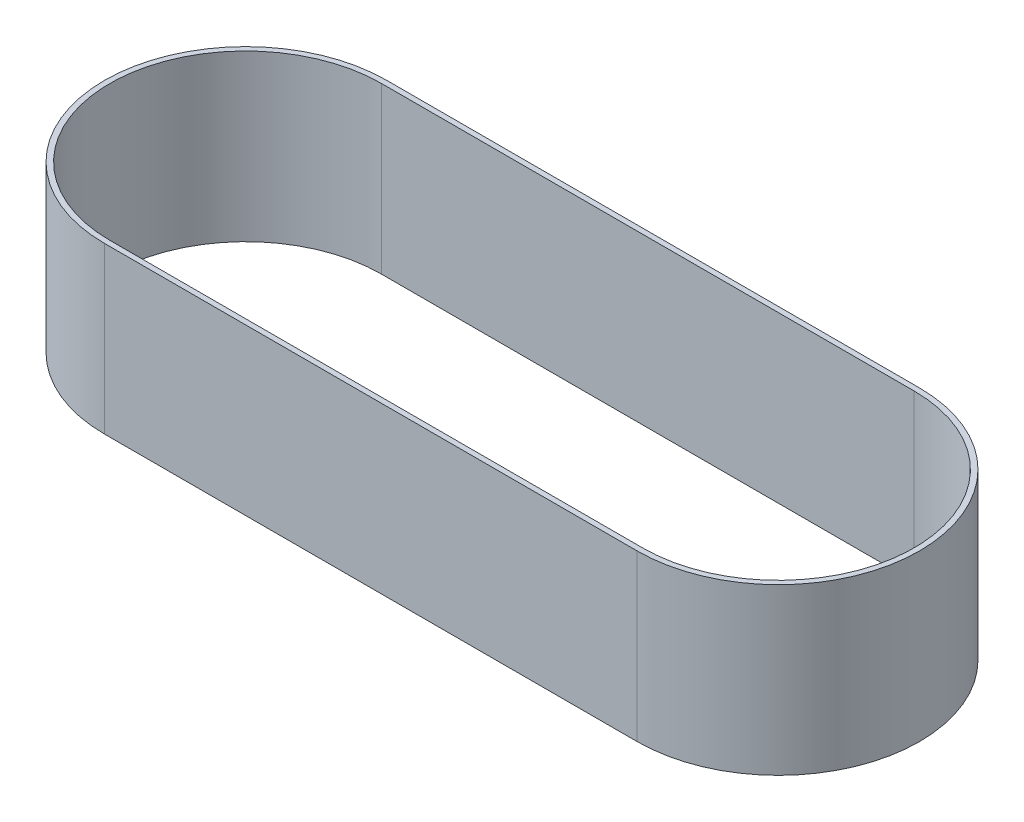
ISO-10303-21;
HEADER;
FILE_DESCRIPTION(('STEP AP214'),'2;1');
FILE_NAME('part.step','',(''),(''),'','','');
FILE_SCHEMA(('AUTOMOTIVE_DESIGN { 1 0 10303 214 1 1 1 1 }'));
ENDSEC;
DATA;
#1=APPLICATION_CONTEXT('core data for automotive mechanical design processes');
#2=APPLICATION_PROTOCOL_DEFINITION('international standard','automotive_design',2000,#1);
#3=PRODUCT_CONTEXT('',#1,'mechanical');
#4=PRODUCT('Part','Part','',(#3));
#5=PRODUCT_RELATED_PRODUCT_CATEGORY('part','',(#4));
#6=PRODUCT_DEFINITION_FORMATION('','',#4);
#7=PRODUCT_DEFINITION_CONTEXT('part definition',#1,'design');
#8=PRODUCT_DEFINITION('design','',#6,#7);
#9=PRODUCT_DEFINITION_SHAPE('','',#8);
#10=(LENGTH_UNIT() NAMED_UNIT(*) SI_UNIT(.MILLI.,.METRE.));
#11=(NAMED_UNIT(*) PLANE_ANGLE_UNIT() SI_UNIT($,.RADIAN.));
#12=(NAMED_UNIT(*) SI_UNIT($,.STERADIAN.) SOLID_ANGLE_UNIT());
#13=UNCERTAINTY_MEASURE_WITH_UNIT(LENGTH_MEASURE(1.E-05),#10,'distance_accuracy_value','');
#14=(GEOMETRIC_REPRESENTATION_CONTEXT(3) GLOBAL_UNCERTAINTY_ASSIGNED_CONTEXT((#13)) GLOBAL_UNIT_ASSIGNED_CONTEXT((#10,
#11,#12)) REPRESENTATION_CONTEXT('',''));
#15=CARTESIAN_POINT('',(0.,0.,0.));
#16=DIRECTION('',(0.,0.,1.));
#17=DIRECTION('',(1.,0.,0.));
#18=AXIS2_PLACEMENT_3D('',#15,#16,#17);
#19=CARTESIAN_POINT('',(0.,62.,53.));
#20=DIRECTION('',(0.,0.,-1.));
#21=DIRECTION('',(-1.,0.,0.));
#22=AXIS2_PLACEMENT_3D('',#19,#20,#21);
#23=PLANE('',#22);
#24=DIRECTION('',(1.,0.,0.));
#25=VECTOR('',#24,1.);
#26=CARTESIAN_POINT('',(0.,0.,53.));
#27=LINE('',#26,#25);
#28=CARTESIAN_POINT('',(-100.,0.,53.));
#29=VERTEX_POINT('',#28);
#30=CARTESIAN_POINT('',(100.,0.,53.));
#31=VERTEX_POINT('',#30);
#32=EDGE_CURVE('E141',#29,#31,#27,.T.);
#33=ORIENTED_EDGE('',*,*,#32,.T.);
#34=DIRECTION('',(0.,-1.,0.));
#35=VECTOR('',#34,1.);
#36=CARTESIAN_POINT('',(100.,62.,53.));
#37=LINE('',#36,#35);
#38=CARTESIAN_POINT('',(100.,62.,53.));
#39=VERTEX_POINT('',#38);
#40=EDGE_CURVE('E11',#39,#31,#37,.T.);
#41=ORIENTED_EDGE('',*,*,#40,.F.);
#42=DIRECTION('',(1.,0.,0.));
#43=VECTOR('',#42,1.);
#44=CARTESIAN_POINT('',(0.,62.,53.));
#45=LINE('',#44,#43);
#46=CARTESIAN_POINT('',(-100.,62.,53.));
#47=VERTEX_POINT('',#46);
#48=EDGE_CURVE('E112',#47,#39,#45,.T.);
#49=ORIENTED_EDGE('',*,*,#48,.F.);
#50=DIRECTION('',(0.,-1.,0.));
#51=VECTOR('',#50,1.);
#52=CARTESIAN_POINT('',(-100.,62.,53.));
#53=LINE('',#52,#51);
#54=EDGE_CURVE('E149',#47,#29,#53,.T.);
#55=ORIENTED_EDGE('',*,*,#54,.T.);
#56=EDGE_LOOP('',(#33,#41,#49,#55));
#57=FACE_BOUND('',#56,.T.);
#58=ADVANCED_FACE('F35',(#57),#23,.F.);
#59=CARTESIAN_POINT('',(100.,62.,0.));
#60=DIRECTION('',(0.,-1.,0.));
#61=DIRECTION('',(0.,0.,-1.));
#62=AXIS2_PLACEMENT_3D('',#59,#60,#61);
#63=CYLINDRICAL_SURFACE('',#62,53.);
#64=CARTESIAN_POINT('',(100.,0.,0.));
#65=DIRECTION('',(0.,1.,0.));
#66=DIRECTION('',(0.,0.,1.));
#67=AXIS2_PLACEMENT_3D('',#64,#65,#66);
#68=CIRCLE('',#67,53.);
#69=CARTESIAN_POINT('',(100.,0.,-53.));
#70=VERTEX_POINT('',#69);
#71=EDGE_CURVE('E118',#31,#70,#68,.T.);
#72=ORIENTED_EDGE('',*,*,#71,.T.);
#73=DIRECTION('',(0.,-1.,0.));
#74=VECTOR('',#73,1.);
#75=CARTESIAN_POINT('',(100.,62.,-53.));
#76=LINE('',#75,#74);
#77=CARTESIAN_POINT('',(100.,62.,-53.));
#78=VERTEX_POINT('',#77);
#79=EDGE_CURVE('E45',#78,#70,#76,.T.);
#80=ORIENTED_EDGE('',*,*,#79,.F.);
#81=CARTESIAN_POINT('',(100.,62.,0.));
#82=DIRECTION('',(0.,1.,0.));
#83=DIRECTION('',(0.,0.,1.));
#84=AXIS2_PLACEMENT_3D('',#81,#82,#83);
#85=CIRCLE('',#84,53.);
#86=EDGE_CURVE('E106',#39,#78,#85,.T.);
#87=ORIENTED_EDGE('',*,*,#86,.F.);
#88=ORIENTED_EDGE('',*,*,#40,.T.);
#89=EDGE_LOOP('',(#72,#80,#87,#88));
#90=FACE_BOUND('',#89,.T.);
#91=ADVANCED_FACE('F117',(#90),#63,.T.);
#92=CARTESIAN_POINT('',(0.,62.,-53.));
#93=DIRECTION('',(0.,0.,-1.));
#94=DIRECTION('',(-1.,0.,0.));
#95=AXIS2_PLACEMENT_3D('',#92,#93,#94);
#96=PLANE('',#95);
#97=DIRECTION('',(1.,0.,0.));
#98=VECTOR('',#97,1.);
#99=CARTESIAN_POINT('',(0.,0.,-53.));
#100=LINE('',#99,#98);
#101=CARTESIAN_POINT('',(-100.,0.,-53.));
#102=VERTEX_POINT('',#101);
#103=EDGE_CURVE('E145',#102,#70,#100,.T.);
#104=ORIENTED_EDGE('',*,*,#103,.F.);
#105=DIRECTION('',(0.,-1.,0.));
#106=VECTOR('',#105,1.);
#107=CARTESIAN_POINT('',(-100.,62.,-53.));
#108=LINE('',#107,#106);
#109=CARTESIAN_POINT('',(-100.,62.,-53.));
#110=VERTEX_POINT('',#109);
#111=EDGE_CURVE('E82',#110,#102,#108,.T.);
#112=ORIENTED_EDGE('',*,*,#111,.F.);
#113=DIRECTION('',(1.,0.,0.));
#114=VECTOR('',#113,1.);
#115=CARTESIAN_POINT('',(0.,62.,-53.));
#116=LINE('',#115,#114);
#117=EDGE_CURVE('E110',#110,#78,#116,.T.);
#118=ORIENTED_EDGE('',*,*,#117,.T.);
#119=ORIENTED_EDGE('',*,*,#79,.T.);
#120=EDGE_LOOP('',(#104,#112,#118,#119));
#121=FACE_BOUND('',#120,.T.);
#122=ADVANCED_FACE('F123',(#121),#96,.T.);
#123=CARTESIAN_POINT('',(-100.,62.,0.));
#124=DIRECTION('',(0.,-1.,0.));
#125=DIRECTION('',(0.,0.,-1.));
#126=AXIS2_PLACEMENT_3D('',#123,#124,#125);
#127=CYLINDRICAL_SURFACE('',#126,51.);
#128=CARTESIAN_POINT('',(-100.,0.,0.));
#129=DIRECTION('',(0.,1.,0.));
#130=DIRECTION('',(0.,0.,1.));
#131=AXIS2_PLACEMENT_3D('',#128,#129,#130);
#132=CIRCLE('',#131,51.);
#133=CARTESIAN_POINT('',(-100.,0.,-51.));
#134=VERTEX_POINT('',#133);
#135=CARTESIAN_POINT('',(-100.,0.,51.));
#136=VERTEX_POINT('',#135);
#137=EDGE_CURVE('E129',#134,#136,#132,.T.);
#138=ORIENTED_EDGE('',*,*,#137,.F.);
#139=DIRECTION('',(0.,-1.,0.));
#140=VECTOR('',#139,1.);
#141=CARTESIAN_POINT('',(-100.,62.,-51.));
#142=LINE('',#141,#140);
#143=CARTESIAN_POINT('',(-100.,62.,-51.));
#144=VERTEX_POINT('',#143);
#145=EDGE_CURVE('E39',#144,#134,#142,.T.);
#146=ORIENTED_EDGE('',*,*,#145,.F.);
#147=CARTESIAN_POINT('',(-100.,62.,0.));
#148=DIRECTION('',(0.,1.,0.));
#149=DIRECTION('',(0.,0.,1.));
#150=AXIS2_PLACEMENT_3D('',#147,#148,#149);
#151=CIRCLE('',#150,51.);
#152=CARTESIAN_POINT('',(-100.,62.,51.));
#153=VERTEX_POINT('',#152);
#154=EDGE_CURVE('E148',#144,#153,#151,.T.);
#155=ORIENTED_EDGE('',*,*,#154,.T.);
#156=DIRECTION('',(0.,-1.,0.));
#157=VECTOR('',#156,1.);
#158=CARTESIAN_POINT('',(-100.,62.,51.));
#159=LINE('',#158,#157);
#160=EDGE_CURVE('E125',#153,#136,#159,.T.);
#161=ORIENTED_EDGE('',*,*,#160,.T.);
#162=EDGE_LOOP('',(#138,#146,#155,#161));
#163=FACE_BOUND('',#162,.T.);
#164=ADVANCED_FACE('F37',(#163),#127,.F.);
#165=CARTESIAN_POINT('',(0.,62.,-51.));
#166=DIRECTION('',(0.,0.,-1.));
#167=DIRECTION('',(-1.,0.,0.));
#168=AXIS2_PLACEMENT_3D('',#165,#166,#167);
#169=PLANE('',#168);
#170=DIRECTION('',(1.,0.,0.));
#171=VECTOR('',#170,1.);
#172=CARTESIAN_POINT('',(0.,0.,-51.));
#173=LINE('',#172,#171);
#174=CARTESIAN_POINT('',(100.,0.,-51.));
#175=VERTEX_POINT('',#174);
#176=EDGE_CURVE('E132',#134,#175,#173,.T.);
#177=ORIENTED_EDGE('',*,*,#176,.T.);
#178=DIRECTION('',(0.,-1.,0.));
#179=VECTOR('',#178,1.);
#180=CARTESIAN_POINT('',(100.,62.,-51.));
#181=LINE('',#180,#179);
#182=CARTESIAN_POINT('',(100.,62.,-51.));
#183=VERTEX_POINT('',#182);
#184=EDGE_CURVE('E154',#183,#175,#181,.T.);
#185=ORIENTED_EDGE('',*,*,#184,.F.);
#186=DIRECTION('',(1.,0.,0.));
#187=VECTOR('',#186,1.);
#188=CARTESIAN_POINT('',(0.,62.,-51.));
#189=LINE('',#188,#187);
#190=EDGE_CURVE('E162',#144,#183,#189,.T.);
#191=ORIENTED_EDGE('',*,*,#190,.F.);
#192=ORIENTED_EDGE('',*,*,#145,.T.);
#193=EDGE_LOOP('',(#177,#185,#191,#192));
#194=FACE_BOUND('',#193,.T.);
#195=ADVANCED_FACE('F161',(#194),#169,.F.);
#196=CARTESIAN_POINT('',(100.,62.,0.));
#197=DIRECTION('',(0.,-1.,0.));
#198=DIRECTION('',(0.,0.,-1.));
#199=AXIS2_PLACEMENT_3D('',#196,#197,#198);
#200=CYLINDRICAL_SURFACE('',#199,51.);
#201=CARTESIAN_POINT('',(100.,0.,0.));
#202=DIRECTION('',(0.,1.,0.));
#203=DIRECTION('',(0.,0.,1.));
#204=AXIS2_PLACEMENT_3D('',#201,#202,#203);
#205=CIRCLE('',#204,51.);
#206=CARTESIAN_POINT('',(100.,0.,51.));
#207=VERTEX_POINT('',#206);
#208=EDGE_CURVE('E135',#207,#175,#205,.T.);
#209=ORIENTED_EDGE('',*,*,#208,.F.);
#210=DIRECTION('',(0.,-1.,0.));
#211=VECTOR('',#210,1.);
#212=CARTESIAN_POINT('',(100.,62.,51.));
#213=LINE('',#212,#211);
#214=CARTESIAN_POINT('',(100.,62.,51.));
#215=VERTEX_POINT('',#214);
#216=EDGE_CURVE('E153',#215,#207,#213,.T.);
#217=ORIENTED_EDGE('',*,*,#216,.F.);
#218=CARTESIAN_POINT('',(100.,62.,0.));
#219=DIRECTION('',(0.,1.,0.));
#220=DIRECTION('',(0.,0.,1.));
#221=AXIS2_PLACEMENT_3D('',#218,#219,#220);
#222=CIRCLE('',#221,51.);
#223=EDGE_CURVE('E202',#215,#183,#222,.T.);
#224=ORIENTED_EDGE('',*,*,#223,.T.);
#225=ORIENTED_EDGE('',*,*,#184,.T.);
#226=EDGE_LOOP('',(#209,#217,#224,#225));
#227=FACE_BOUND('',#226,.T.);
#228=ADVANCED_FACE('F174',(#227),#200,.F.);
#229=CARTESIAN_POINT('',(0.,62.,51.));
#230=DIRECTION('',(0.,0.,-1.));
#231=DIRECTION('',(-1.,0.,0.));
#232=AXIS2_PLACEMENT_3D('',#229,#230,#231);
#233=PLANE('',#232);
#234=DIRECTION('',(1.,0.,0.));
#235=VECTOR('',#234,1.);
#236=CARTESIAN_POINT('',(0.,0.,51.));
#237=LINE('',#236,#235);
#238=EDGE_CURVE('E138',#136,#207,#237,.T.);
#239=ORIENTED_EDGE('',*,*,#238,.F.);
#240=ORIENTED_EDGE('',*,*,#160,.F.);
#241=DIRECTION('',(1.,0.,0.));
#242=VECTOR('',#241,1.);
#243=CARTESIAN_POINT('',(0.,62.,51.));
#244=LINE('',#243,#242);
#245=EDGE_CURVE('E172',#153,#215,#244,.T.);
#246=ORIENTED_EDGE('',*,*,#245,.T.);
#247=ORIENTED_EDGE('',*,*,#216,.T.);
#248=EDGE_LOOP('',(#239,#240,#246,#247));
#249=FACE_BOUND('',#248,.T.);
#250=ADVANCED_FACE('F171',(#249),#233,.T.);
#251=CARTESIAN_POINT('',(-100.,62.,0.));
#252=DIRECTION('',(0.,-1.,0.));
#253=DIRECTION('',(0.,0.,-1.));
#254=AXIS2_PLACEMENT_3D('',#251,#252,#253);
#255=CYLINDRICAL_SURFACE('',#254,53.);
#256=CARTESIAN_POINT('',(-100.,0.,0.));
#257=DIRECTION('',(0.,1.,0.));
#258=DIRECTION('',(0.,0.,1.));
#259=AXIS2_PLACEMENT_3D('',#256,#257,#258);
#260=CIRCLE('',#259,53.);
#261=EDGE_CURVE('E85',#102,#29,#260,.T.);
#262=ORIENTED_EDGE('',*,*,#261,.T.);
#263=ORIENTED_EDGE('',*,*,#54,.F.);
#264=CARTESIAN_POINT('',(-100.,62.,0.));
#265=DIRECTION('',(0.,1.,0.));
#266=DIRECTION('',(0.,0.,1.));
#267=AXIS2_PLACEMENT_3D('',#264,#265,#266);
#268=CIRCLE('',#267,53.);
#269=EDGE_CURVE('E54',#110,#47,#268,.T.);
#270=ORIENTED_EDGE('',*,*,#269,.F.);
#271=ORIENTED_EDGE('',*,*,#111,.T.);
#272=EDGE_LOOP('',(#262,#263,#270,#271));
#273=FACE_BOUND('',#272,.T.);
#274=ADVANCED_FACE('F181',(#273),#255,.T.);
#275=CARTESIAN_POINT('',(0.,62.,0.));
#276=DIRECTION('',(0.,1.,0.));
#277=DIRECTION('',(0.,0.,1.));
#278=AXIS2_PLACEMENT_3D('',#275,#276,#277);
#279=PLANE('',#278);
#280=ORIENTED_EDGE('',*,*,#154,.F.);
#281=ORIENTED_EDGE('',*,*,#190,.T.);
#282=ORIENTED_EDGE('',*,*,#223,.F.);
#283=ORIENTED_EDGE('',*,*,#245,.F.);
#284=EDGE_LOOP('',(#280,#281,#282,#283));
#285=FACE_BOUND('',#284,.T.);
#286=ORIENTED_EDGE('',*,*,#48,.T.);
#287=ORIENTED_EDGE('',*,*,#86,.T.);
#288=ORIENTED_EDGE('',*,*,#117,.F.);
#289=ORIENTED_EDGE('',*,*,#269,.T.);
#290=EDGE_LOOP('',(#286,#287,#288,#289));
#291=FACE_BOUND('',#290,.T.);
#292=ADVANCED_FACE('F108',(#285,#291),#279,.T.);
#293=CARTESIAN_POINT('',(0.,0.,0.));
#294=DIRECTION('',(0.,1.,0.));
#295=DIRECTION('',(0.,0.,1.));
#296=AXIS2_PLACEMENT_3D('',#293,#294,#295);
#297=PLANE('',#296);
#298=ORIENTED_EDGE('',*,*,#137,.T.);
#299=ORIENTED_EDGE('',*,*,#238,.T.);
#300=ORIENTED_EDGE('',*,*,#208,.T.);
#301=ORIENTED_EDGE('',*,*,#176,.F.);
#302=EDGE_LOOP('',(#298,#299,#300,#301));
#303=FACE_BOUND('',#302,.T.);
#304=ORIENTED_EDGE('',*,*,#32,.F.);
#305=ORIENTED_EDGE('',*,*,#261,.F.);
#306=ORIENTED_EDGE('',*,*,#103,.T.);
#307=ORIENTED_EDGE('',*,*,#71,.F.);
#308=EDGE_LOOP('',(#304,#305,#306,#307));
#309=FACE_BOUND('',#308,.T.);
#310=ADVANCED_FACE('F165',(#303,#309),#297,.F.);
#311=CLOSED_SHELL('',(#58,#91,#122,#164,#195,#228,#250,#274,#292,#310));
#312=MANIFOLD_SOLID_BREP('B2',#311);
#313=ADVANCED_BREP_SHAPE_REPRESENTATION('',(#18,#312),#14);
#314=SHAPE_DEFINITION_REPRESENTATION(#9,#313);
ENDSEC;
END-ISO-10303-21;
